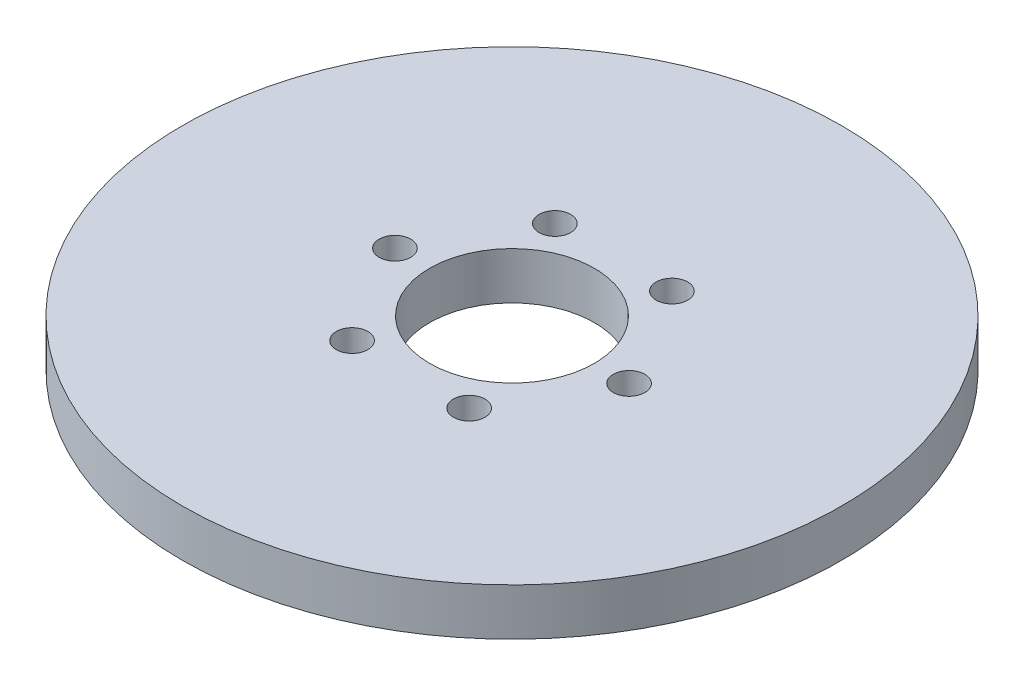
ISO-10303-21;
HEADER;
FILE_DESCRIPTION(('STEP AP214'),'2;1');
FILE_NAME('part.step','',(''),(''),'','','');
FILE_SCHEMA(('AUTOMOTIVE_DESIGN { 1 0 10303 214 1 1 1 1 }'));
ENDSEC;
DATA;
#1=APPLICATION_CONTEXT('core data for automotive mechanical design processes');
#2=APPLICATION_PROTOCOL_DEFINITION('international standard','automotive_design',2000,#1);
#3=PRODUCT_CONTEXT('',#1,'mechanical');
#4=PRODUCT('Part','Part','',(#3));
#5=PRODUCT_RELATED_PRODUCT_CATEGORY('part','',(#4));
#6=PRODUCT_DEFINITION_FORMATION('','',#4);
#7=PRODUCT_DEFINITION_CONTEXT('part definition',#1,'design');
#8=PRODUCT_DEFINITION('design','',#6,#7);
#9=PRODUCT_DEFINITION_SHAPE('','',#8);
#10=(LENGTH_UNIT() NAMED_UNIT(*) SI_UNIT(.MILLI.,.METRE.));
#11=(NAMED_UNIT(*) PLANE_ANGLE_UNIT() SI_UNIT($,.RADIAN.));
#12=(NAMED_UNIT(*) SI_UNIT($,.STERADIAN.) SOLID_ANGLE_UNIT());
#13=UNCERTAINTY_MEASURE_WITH_UNIT(LENGTH_MEASURE(1.E-05),#10,'distance_accuracy_value','');
#14=(GEOMETRIC_REPRESENTATION_CONTEXT(3) GLOBAL_UNCERTAINTY_ASSIGNED_CONTEXT((#13)) GLOBAL_UNIT_ASSIGNED_CONTEXT((#10,
#11,#12)) REPRESENTATION_CONTEXT('',''));
#15=CARTESIAN_POINT('',(0.,0.,0.));
#16=DIRECTION('',(0.,0.,1.));
#17=DIRECTION('',(1.,0.,0.));
#18=AXIS2_PLACEMENT_3D('',#15,#16,#17);
#19=CARTESIAN_POINT('',(0.,10.,0.));
#20=DIRECTION('',(0.,-1.,0.));
#21=DIRECTION('',(0.,0.,-1.));
#22=AXIS2_PLACEMENT_3D('',#19,#20,#21);
#23=CYLINDRICAL_SURFACE('',#22,70.);
#24=CARTESIAN_POINT('',(0.,10.,0.));
#25=DIRECTION('',(0.,1.,0.));
#26=DIRECTION('',(0.,0.,1.));
#27=AXIS2_PLACEMENT_3D('',#24,#25,#26);
#28=CIRCLE('',#27,70.);
#29=CARTESIAN_POINT('',(0.,10.,70.));
#30=VERTEX_POINT('',#29);
#31=EDGE_CURVE('E10',#30,#30,#28,.T.);
#32=ORIENTED_EDGE('',*,*,#31,.F.);
#33=EDGE_LOOP('',(#32));
#34=FACE_BOUND('',#33,.T.);
#35=CARTESIAN_POINT('',(0.,0.,0.));
#36=DIRECTION('',(0.,1.,0.));
#37=DIRECTION('',(0.,0.,1.));
#38=AXIS2_PLACEMENT_3D('',#35,#36,#37);
#39=CIRCLE('',#38,70.);
#40=CARTESIAN_POINT('',(0.,0.,70.));
#41=VERTEX_POINT('',#40);
#42=EDGE_CURVE('E37',#41,#41,#39,.T.);
#43=ORIENTED_EDGE('',*,*,#42,.T.);
#44=EDGE_LOOP('',(#43));
#45=FACE_BOUND('',#44,.T.);
#46=ADVANCED_FACE('F40',(#34,#45),#23,.T.);
#47=CARTESIAN_POINT('',(0.,10.,0.));
#48=DIRECTION('',(0.,1.,0.));
#49=DIRECTION('',(0.,0.,1.));
#50=AXIS2_PLACEMENT_3D('',#47,#48,#49);
#51=PLANE('',#50);
#52=CARTESIAN_POINT('',(-12.4331608319585,10.,-21.5348662596269));
#53=DIRECTION('',(0.,1.,0.));
#54=DIRECTION('',(-0.866025403784433,0.,0.50000000000001));
#55=AXIS2_PLACEMENT_3D('',#52,#53,#54);
#56=CIRCLE('',#55,3.35673511141549);
#57=CARTESIAN_POINT('',(-15.3401787122195,10.,-19.8564987039191));
#58=VERTEX_POINT('',#57);
#59=EDGE_CURVE('E70',#58,#58,#56,.T.);
#60=ORIENTED_EDGE('',*,*,#59,.F.);
#61=EDGE_LOOP('',(#60));
#62=FACE_BOUND('',#61,.T.);
#63=CARTESIAN_POINT('',(12.4331608319581,10.,-21.5348662596271));
#64=DIRECTION('',(0.,1.,0.));
#65=DIRECTION('',(-0.866025403784443,0.,-0.499999999999992));
#66=AXIS2_PLACEMENT_3D('',#63,#64,#65);
#67=CIRCLE('',#66,3.35673511141549);
#68=CARTESIAN_POINT('',(9.52614295169704,10.,-23.2132338153349));
#69=VERTEX_POINT('',#68);
#70=EDGE_CURVE('E71',#69,#69,#67,.T.);
#71=ORIENTED_EDGE('',*,*,#70,.F.);
#72=EDGE_LOOP('',(#71));
#73=FACE_BOUND('',#72,.T.);
#74=CARTESIAN_POINT('',(24.8663216639165,10.,0.));
#75=DIRECTION('',(0.,1.,0.));
#76=DIRECTION('',(0.,0.,-1.));
#77=AXIS2_PLACEMENT_3D('',#74,#75,#76);
#78=CIRCLE('',#77,3.35673511141549);
#79=CARTESIAN_POINT('',(24.8663216639165,10.,-3.35673511141549));
#80=VERTEX_POINT('',#79);
#81=EDGE_CURVE('E78',#80,#80,#78,.T.);
#82=ORIENTED_EDGE('',*,*,#81,.F.);
#83=EDGE_LOOP('',(#82));
#84=FACE_BOUND('',#83,.T.);
#85=CARTESIAN_POINT('',(12.4331608319584,10.,21.534866259627));
#86=DIRECTION('',(0.,1.,0.));
#87=DIRECTION('',(0.866025403784436,0.,-0.500000000000004));
#88=AXIS2_PLACEMENT_3D('',#85,#86,#87);
#89=CIRCLE('',#88,3.35673511141549);
#90=CARTESIAN_POINT('',(15.3401787122194,10.,19.8564987039192));
#91=VERTEX_POINT('',#90);
#92=EDGE_CURVE('E84',#91,#91,#89,.T.);
#93=ORIENTED_EDGE('',*,*,#92,.F.);
#94=EDGE_LOOP('',(#93));
#95=FACE_BOUND('',#94,.T.);
#96=CARTESIAN_POINT('',(-12.4331608319582,10.,21.5348662596271));
#97=DIRECTION('',(0.,1.,0.));
#98=DIRECTION('',(0.86602540378444,0.,0.499999999999998));
#99=AXIS2_PLACEMENT_3D('',#96,#97,#98);
#100=CIRCLE('',#99,3.35673511141549);
#101=CARTESIAN_POINT('',(-9.5261429516972,10.,23.2132338153348));
#102=VERTEX_POINT('',#101);
#103=EDGE_CURVE('E61',#102,#102,#100,.T.);
#104=ORIENTED_EDGE('',*,*,#103,.F.);
#105=EDGE_LOOP('',(#104));
#106=FACE_BOUND('',#105,.T.);
#107=CARTESIAN_POINT('',(-24.8663216639165,10.,0.));
#108=DIRECTION('',(0.,1.,0.));
#109=DIRECTION('',(0.,0.,1.));
#110=AXIS2_PLACEMENT_3D('',#107,#108,#109);
#111=CIRCLE('',#110,3.35673511141549);
#112=CARTESIAN_POINT('',(-24.8663216639165,10.,3.35673511141549));
#113=VERTEX_POINT('',#112);
#114=EDGE_CURVE('E54',#113,#113,#111,.T.);
#115=ORIENTED_EDGE('',*,*,#114,.F.);
#116=EDGE_LOOP('',(#115));
#117=FACE_BOUND('',#116,.T.);
#118=CARTESIAN_POINT('',(0.,10.,0.));
#119=DIRECTION('',(0.,1.,0.));
#120=DIRECTION('',(0.,0.,1.));
#121=AXIS2_PLACEMENT_3D('',#118,#119,#120);
#122=CIRCLE('',#121,17.5);
#123=CARTESIAN_POINT('',(0.,10.,17.5));
#124=VERTEX_POINT('',#123);
#125=EDGE_CURVE('E50',#124,#124,#122,.T.);
#126=ORIENTED_EDGE('',*,*,#125,.F.);
#127=EDGE_LOOP('',(#126));
#128=FACE_BOUND('',#127,.T.);
#129=ORIENTED_EDGE('',*,*,#31,.T.);
#130=EDGE_LOOP('',(#129));
#131=FACE_BOUND('',#130,.T.);
#132=ADVANCED_FACE('F99',(#62,#73,#84,#95,#106,#117,#128,#131),#51,.T.);
#133=CARTESIAN_POINT('',(0.,0.,0.));
#134=DIRECTION('',(0.,1.,0.));
#135=DIRECTION('',(0.,0.,1.));
#136=AXIS2_PLACEMENT_3D('',#133,#134,#135);
#137=PLANE('',#136);
#138=CARTESIAN_POINT('',(0.,0.,0.));
#139=DIRECTION('',(0.,1.,0.));
#140=DIRECTION('',(0.,0.,1.));
#141=AXIS2_PLACEMENT_3D('',#138,#139,#140);
#142=CIRCLE('',#141,17.5);
#143=CARTESIAN_POINT('',(0.,0.,17.5));
#144=VERTEX_POINT('',#143);
#145=EDGE_CURVE('E47',#144,#144,#142,.T.);
#146=ORIENTED_EDGE('',*,*,#145,.T.);
#147=EDGE_LOOP('',(#146));
#148=FACE_BOUND('',#147,.T.);
#149=ORIENTED_EDGE('',*,*,#42,.F.);
#150=EDGE_LOOP('',(#149));
#151=FACE_BOUND('',#150,.T.);
#152=ADVANCED_FACE('F103',(#148,#151),#137,.F.);
#153=CARTESIAN_POINT('',(0.,10.,0.));
#154=DIRECTION('',(0.,-1.,0.));
#155=DIRECTION('',(0.,0.,-1.));
#156=AXIS2_PLACEMENT_3D('',#153,#154,#155);
#157=CYLINDRICAL_SURFACE('',#156,17.5);
#158=ORIENTED_EDGE('',*,*,#125,.T.);
#159=EDGE_LOOP('',(#158));
#160=FACE_BOUND('',#159,.T.);
#161=ORIENTED_EDGE('',*,*,#145,.F.);
#162=EDGE_LOOP('',(#161));
#163=FACE_BOUND('',#162,.T.);
#164=ADVANCED_FACE('F115',(#160,#163),#157,.F.);
#165=CARTESIAN_POINT('',(-24.8663216639165,0.822804516971502,0.));
#166=DIRECTION('',(0.,1.,0.));
#167=DIRECTION('',(0.,0.,1.));
#168=AXIS2_PLACEMENT_3D('',#165,#166,#167);
#169=CYLINDRICAL_SURFACE('',#168,3.35673511141549);
#170=CARTESIAN_POINT('',(-24.8663216639165,0.822804516971502,0.));
#171=DIRECTION('',(0.,1.,0.));
#172=DIRECTION('',(0.,0.,1.));
#173=AXIS2_PLACEMENT_3D('',#170,#171,#172);
#174=CIRCLE('',#173,3.35673511141549);
#175=CARTESIAN_POINT('',(-24.8663216639165,0.822804516971502,3.35673511141549));
#176=VERTEX_POINT('',#175);
#177=EDGE_CURVE('E55',#176,#176,#174,.T.);
#178=ORIENTED_EDGE('',*,*,#177,.F.);
#179=EDGE_LOOP('',(#178));
#180=FACE_BOUND('',#179,.T.);
#181=ORIENTED_EDGE('',*,*,#114,.T.);
#182=EDGE_LOOP('',(#181));
#183=FACE_BOUND('',#182,.T.);
#184=ADVANCED_FACE('F113',(#180,#183),#169,.F.);
#185=CARTESIAN_POINT('',(-24.8663216639165,0.822804516971502,0.));
#186=DIRECTION('',(0.,1.,0.));
#187=DIRECTION('',(0.,0.,1.));
#188=AXIS2_PLACEMENT_3D('',#185,#186,#187);
#189=PLANE('',#188);
#190=ORIENTED_EDGE('',*,*,#177,.T.);
#191=EDGE_LOOP('',(#190));
#192=FACE_BOUND('',#191,.T.);
#193=ADVANCED_FACE('F144',(#192),#189,.T.);
#194=CARTESIAN_POINT('',(-12.4331608319582,0.822804516971502,21.5348662596271));
#195=DIRECTION('',(0.,1.,0.));
#196=DIRECTION('',(0.,0.,1.));
#197=AXIS2_PLACEMENT_3D('',#194,#195,#196);
#198=CYLINDRICAL_SURFACE('',#197,3.35673511141549);
#199=CARTESIAN_POINT('',(-12.4331608319582,0.822804516971502,21.5348662596271));
#200=DIRECTION('',(0.,1.,0.));
#201=DIRECTION('',(0.86602540378444,0.,0.499999999999998));
#202=AXIS2_PLACEMENT_3D('',#199,#200,#201);
#203=CIRCLE('',#202,3.35673511141549);
#204=CARTESIAN_POINT('',(-9.5261429516972,0.822804516971502,23.2132338153348));
#205=VERTEX_POINT('',#204);
#206=EDGE_CURVE('E59',#205,#205,#203,.T.);
#207=ORIENTED_EDGE('',*,*,#206,.F.);
#208=EDGE_LOOP('',(#207));
#209=FACE_BOUND('',#208,.T.);
#210=ORIENTED_EDGE('',*,*,#103,.T.);
#211=EDGE_LOOP('',(#210));
#212=FACE_BOUND('',#211,.T.);
#213=ADVANCED_FACE('F153',(#209,#212),#198,.F.);
#214=CARTESIAN_POINT('',(-12.4331608319582,0.822804516971502,21.5348662596271));
#215=DIRECTION('',(0.,1.,0.));
#216=DIRECTION('',(0.86602540378444,0.,0.499999999999998));
#217=AXIS2_PLACEMENT_3D('',#214,#215,#216);
#218=PLANE('',#217);
#219=ORIENTED_EDGE('',*,*,#206,.T.);
#220=EDGE_LOOP('',(#219));
#221=FACE_BOUND('',#220,.T.);
#222=ADVANCED_FACE('F96',(#221),#218,.T.);
#223=CARTESIAN_POINT('',(12.4331608319584,0.822804516971502,21.534866259627));
#224=DIRECTION('',(0.,1.,0.));
#225=DIRECTION('',(0.,0.,1.));
#226=AXIS2_PLACEMENT_3D('',#223,#224,#225);
#227=CYLINDRICAL_SURFACE('',#226,3.35673511141549);
#228=CARTESIAN_POINT('',(12.4331608319584,0.822804516971502,21.534866259627));
#229=DIRECTION('',(0.,1.,0.));
#230=DIRECTION('',(0.866025403784436,0.,-0.500000000000004));
#231=AXIS2_PLACEMENT_3D('',#228,#229,#230);
#232=CIRCLE('',#231,3.35673511141549);
#233=CARTESIAN_POINT('',(15.3401787122194,0.822804516971502,19.8564987039192));
#234=VERTEX_POINT('',#233);
#235=EDGE_CURVE('E63',#234,#234,#232,.T.);
#236=ORIENTED_EDGE('',*,*,#235,.F.);
#237=EDGE_LOOP('',(#236));
#238=FACE_BOUND('',#237,.T.);
#239=ORIENTED_EDGE('',*,*,#92,.T.);
#240=EDGE_LOOP('',(#239));
#241=FACE_BOUND('',#240,.T.);
#242=ADVANCED_FACE('F91',(#238,#241),#227,.F.);
#243=CARTESIAN_POINT('',(12.4331608319584,0.822804516971502,21.534866259627));
#244=DIRECTION('',(0.,1.,0.));
#245=DIRECTION('',(0.866025403784436,0.,-0.500000000000004));
#246=AXIS2_PLACEMENT_3D('',#243,#244,#245);
#247=PLANE('',#246);
#248=ORIENTED_EDGE('',*,*,#235,.T.);
#249=EDGE_LOOP('',(#248));
#250=FACE_BOUND('',#249,.T.);
#251=ADVANCED_FACE('F93',(#250),#247,.T.);
#252=CARTESIAN_POINT('',(24.8663216639165,0.822804516971502,0.));
#253=DIRECTION('',(0.,1.,0.));
#254=DIRECTION('',(0.,0.,1.));
#255=AXIS2_PLACEMENT_3D('',#252,#253,#254);
#256=CYLINDRICAL_SURFACE('',#255,3.35673511141549);
#257=CARTESIAN_POINT('',(24.8663216639165,0.822804516971502,0.));
#258=DIRECTION('',(0.,1.,0.));
#259=DIRECTION('',(0.,0.,-1.));
#260=AXIS2_PLACEMENT_3D('',#257,#258,#259);
#261=CIRCLE('',#260,3.35673511141549);
#262=CARTESIAN_POINT('',(24.8663216639165,0.822804516971502,-3.35673511141549));
#263=VERTEX_POINT('',#262);
#264=EDGE_CURVE('E85',#263,#263,#261,.T.);
#265=ORIENTED_EDGE('',*,*,#264,.F.);
#266=EDGE_LOOP('',(#265));
#267=FACE_BOUND('',#266,.T.);
#268=ORIENTED_EDGE('',*,*,#81,.T.);
#269=EDGE_LOOP('',(#268));
#270=FACE_BOUND('',#269,.T.);
#271=ADVANCED_FACE('F187',(#267,#270),#256,.F.);
#272=CARTESIAN_POINT('',(24.8663216639165,0.822804516971502,0.));
#273=DIRECTION('',(0.,1.,0.));
#274=DIRECTION('',(0.,0.,-1.));
#275=AXIS2_PLACEMENT_3D('',#272,#273,#274);
#276=PLANE('',#275);
#277=ORIENTED_EDGE('',*,*,#264,.T.);
#278=EDGE_LOOP('',(#277));
#279=FACE_BOUND('',#278,.T.);
#280=ADVANCED_FACE('F198',(#279),#276,.T.);
#281=CARTESIAN_POINT('',(12.4331608319581,0.822804516971502,-21.5348662596271));
#282=DIRECTION('',(0.,1.,0.));
#283=DIRECTION('',(0.,0.,1.));
#284=AXIS2_PLACEMENT_3D('',#281,#282,#283);
#285=CYLINDRICAL_SURFACE('',#284,3.35673511141549);
#286=CARTESIAN_POINT('',(12.4331608319581,0.822804516971502,-21.5348662596271));
#287=DIRECTION('',(0.,1.,0.));
#288=DIRECTION('',(-0.866025403784443,0.,-0.499999999999992));
#289=AXIS2_PLACEMENT_3D('',#286,#287,#288);
#290=CIRCLE('',#289,3.35673511141549);
#291=CARTESIAN_POINT('',(9.52614295169704,0.822804516971502,-23.2132338153349));
#292=VERTEX_POINT('',#291);
#293=EDGE_CURVE('E76',#292,#292,#290,.T.);
#294=ORIENTED_EDGE('',*,*,#293,.F.);
#295=EDGE_LOOP('',(#294));
#296=FACE_BOUND('',#295,.T.);
#297=ORIENTED_EDGE('',*,*,#70,.T.);
#298=EDGE_LOOP('',(#297));
#299=FACE_BOUND('',#298,.T.);
#300=ADVANCED_FACE('F202',(#296,#299),#285,.F.);
#301=CARTESIAN_POINT('',(12.4331608319581,0.822804516971502,-21.5348662596271));
#302=DIRECTION('',(0.,1.,0.));
#303=DIRECTION('',(-0.866025403784443,0.,-0.499999999999992));
#304=AXIS2_PLACEMENT_3D('',#301,#302,#303);
#305=PLANE('',#304);
#306=ORIENTED_EDGE('',*,*,#293,.T.);
#307=EDGE_LOOP('',(#306));
#308=FACE_BOUND('',#307,.T.);
#309=ADVANCED_FACE('F212',(#308),#305,.T.);
#310=CARTESIAN_POINT('',(-12.4331608319585,0.822804516971502,-21.5348662596269));
#311=DIRECTION('',(0.,1.,0.));
#312=DIRECTION('',(0.,0.,1.));
#313=AXIS2_PLACEMENT_3D('',#310,#311,#312);
#314=CYLINDRICAL_SURFACE('',#313,3.35673511141549);
#315=CARTESIAN_POINT('',(-12.4331608319585,0.822804516971502,-21.5348662596269));
#316=DIRECTION('',(0.,1.,0.));
#317=DIRECTION('',(-0.866025403784433,0.,0.50000000000001));
#318=AXIS2_PLACEMENT_3D('',#315,#316,#317);
#319=CIRCLE('',#318,3.35673511141549);
#320=CARTESIAN_POINT('',(-15.3401787122195,0.822804516971502,-19.8564987039191));
#321=VERTEX_POINT('',#320);
#322=EDGE_CURVE('E69',#321,#321,#319,.T.);
#323=ORIENTED_EDGE('',*,*,#322,.F.);
#324=EDGE_LOOP('',(#323));
#325=FACE_BOUND('',#324,.T.);
#326=ORIENTED_EDGE('',*,*,#59,.T.);
#327=EDGE_LOOP('',(#326));
#328=FACE_BOUND('',#327,.T.);
#329=ADVANCED_FACE('F224',(#325,#328),#314,.F.);
#330=CARTESIAN_POINT('',(-12.4331608319585,0.822804516971502,-21.5348662596269));
#331=DIRECTION('',(0.,1.,0.));
#332=DIRECTION('',(-0.866025403784433,0.,0.50000000000001));
#333=AXIS2_PLACEMENT_3D('',#330,#331,#332);
#334=PLANE('',#333);
#335=ORIENTED_EDGE('',*,*,#322,.T.);
#336=EDGE_LOOP('',(#335));
#337=FACE_BOUND('',#336,.T.);
#338=ADVANCED_FACE('F235',(#337),#334,.T.);
#339=CLOSED_SHELL('',(#46,#132,#152,#164,#184,#193,#213,#222,#242,#251,#271,#280,#300,#309,#329,#338));
#340=MANIFOLD_SOLID_BREP('B2',#339);
#341=ADVANCED_BREP_SHAPE_REPRESENTATION('',(#18,#340),#14);
#342=SHAPE_DEFINITION_REPRESENTATION(#9,#341);
ENDSEC;
END-ISO-10303-21;
